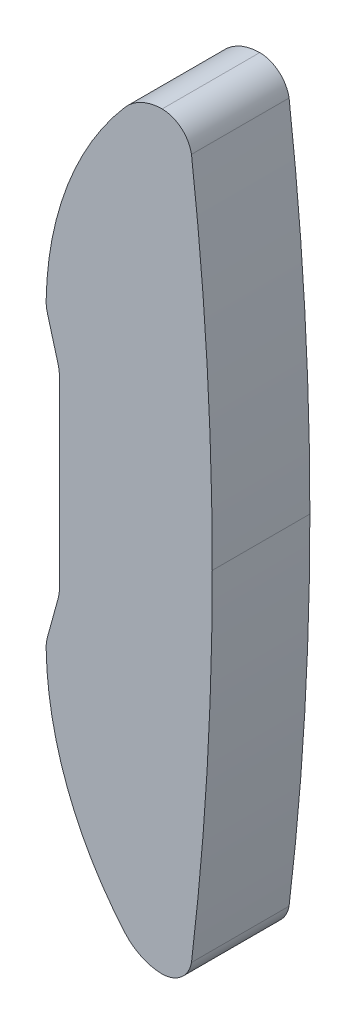
ISO-10303-21;
HEADER;
FILE_DESCRIPTION(('STEP AP214'),'2;1');
FILE_NAME('part.step','',(''),(''),'','','');
FILE_SCHEMA(('AUTOMOTIVE_DESIGN { 1 0 10303 214 1 1 1 1 }'));
ENDSEC;
DATA;
#1=APPLICATION_CONTEXT('core data for automotive mechanical design processes');
#2=APPLICATION_PROTOCOL_DEFINITION('international standard','automotive_design',2000,#1);
#3=PRODUCT_CONTEXT('',#1,'mechanical');
#4=PRODUCT('Part','Part','',(#3));
#5=PRODUCT_RELATED_PRODUCT_CATEGORY('part','',(#4));
#6=PRODUCT_DEFINITION_FORMATION('','',#4);
#7=PRODUCT_DEFINITION_CONTEXT('part definition',#1,'design');
#8=PRODUCT_DEFINITION('design','',#6,#7);
#9=PRODUCT_DEFINITION_SHAPE('','',#8);
#10=(LENGTH_UNIT() NAMED_UNIT(*) SI_UNIT(.MILLI.,.METRE.));
#11=(NAMED_UNIT(*) PLANE_ANGLE_UNIT() SI_UNIT($,.RADIAN.));
#12=(NAMED_UNIT(*) SI_UNIT($,.STERADIAN.) SOLID_ANGLE_UNIT());
#13=UNCERTAINTY_MEASURE_WITH_UNIT(LENGTH_MEASURE(1.E-05),#10,'distance_accuracy_value','');
#14=(GEOMETRIC_REPRESENTATION_CONTEXT(3) GLOBAL_UNCERTAINTY_ASSIGNED_CONTEXT((#13)) GLOBAL_UNIT_ASSIGNED_CONTEXT((#10,
#11,#12)) REPRESENTATION_CONTEXT('',''));
#15=CARTESIAN_POINT('',(0.,0.,0.));
#16=DIRECTION('',(0.,0.,1.));
#17=DIRECTION('',(1.,0.,0.));
#18=AXIS2_PLACEMENT_3D('',#15,#16,#17);
#19=CARTESIAN_POINT('',(-496.845318032392,-60.0507965039955,41.6977423367199));
#20=DIRECTION('',(0.,0.,1.));
#21=DIRECTION('',(1.,0.,0.));
#22=AXIS2_PLACEMENT_3D('',#19,#20,#21);
#23=CYLINDRICAL_SURFACE('',#22,554.203613489206);
#24=CARTESIAN_POINT('',(-496.845318032392,-60.0507965039955,41.6977423367199));
#25=DIRECTION('',(0.,0.,1.));
#26=DIRECTION('',(1.,0.,0.));
#27=AXIS2_PLACEMENT_3D('',#24,#25,#26);
#28=CIRCLE('',#27,554.203613489206);
#29=CARTESIAN_POINT('',(57.3581505300624,-59.6500000000382,41.6977423367199));
#30=VERTEX_POINT('',#29);
#31=CARTESIAN_POINT('',(53.4233595902934,-125.975204972134,41.6977423367199));
#32=VERTEX_POINT('',#31);
#33=EDGE_CURVE('E236',#30,#32,#28,.F.);
#34=ORIENTED_EDGE('',*,*,#33,.F.);
#35=DIRECTION('',(0.,0.,-1.));
#36=VECTOR('',#35,1.);
#37=CARTESIAN_POINT('',(57.3581505300624,-59.6500000000003,50.9477423367199));
#38=LINE('',#37,#36);
#39=CARTESIAN_POINT('',(57.3581505300624,-59.6500000000382,60.1977423367199));
#40=VERTEX_POINT('',#39);
#41=EDGE_CURVE('E190',#40,#30,#38,.T.);
#42=ORIENTED_EDGE('',*,*,#41,.F.);
#43=CARTESIAN_POINT('',(-496.845318032392,-60.0507965039955,60.1977423367199));
#44=DIRECTION('',(0.,0.,1.));
#45=DIRECTION('',(1.,0.,0.));
#46=AXIS2_PLACEMENT_3D('',#43,#44,#45);
#47=CIRCLE('',#46,554.203613489206);
#48=CARTESIAN_POINT('',(53.4233595902862,-125.975204972194,60.1977423367199));
#49=VERTEX_POINT('',#48);
#50=EDGE_CURVE('E245',#49,#40,#47,.T.);
#51=ORIENTED_EDGE('',*,*,#50,.F.);
#52=DIRECTION('',(0.,0.,1.));
#53=VECTOR('',#52,1.);
#54=CARTESIAN_POINT('',(53.4233595902931,-125.975204972136,50.9477423367199));
#55=LINE('',#54,#53);
#56=EDGE_CURVE('E187',#32,#49,#55,.T.);
#57=ORIENTED_EDGE('',*,*,#56,.F.);
#58=EDGE_LOOP('',(#34,#42,#51,#57));
#59=FACE_BOUND('',#58,.T.);
#60=ADVANCED_FACE('F16',(#59),#23,.T.);
#61=CARTESIAN_POINT('',(47.827182422053,-124.963178172978,41.6977423367199));
#62=DIRECTION('',(0.,0.,1.));
#63=DIRECTION('',(1.,0.,0.));
#64=AXIS2_PLACEMENT_3D('',#61,#62,#63);
#65=CYLINDRICAL_SURFACE('',#64,5.68694972199911);
#66=CARTESIAN_POINT('',(47.827182422053,-124.963178172978,41.6977423367199));
#67=DIRECTION('',(0.,0.,1.));
#68=DIRECTION('',(1.,0.,0.));
#69=AXIS2_PLACEMENT_3D('',#66,#67,#68);
#70=CIRCLE('',#69,5.68694972199911);
#71=CARTESIAN_POINT('',(47.8653222732101,-130.65,41.6977423367199));
#72=VERTEX_POINT('',#71);
#73=EDGE_CURVE('E232',#32,#72,#70,.F.);
#74=ORIENTED_EDGE('',*,*,#73,.F.);
#75=ORIENTED_EDGE('',*,*,#56,.T.);
#76=CARTESIAN_POINT('',(47.827182422053,-124.963178172978,60.1977423367199));
#77=DIRECTION('',(0.,0.,1.));
#78=DIRECTION('',(1.,0.,0.));
#79=AXIS2_PLACEMENT_3D('',#76,#77,#78);
#80=CIRCLE('',#79,5.68694972199911);
#81=CARTESIAN_POINT('',(47.8653222732101,-130.65,60.1977423367199));
#82=VERTEX_POINT('',#81);
#83=EDGE_CURVE('E248',#82,#49,#80,.T.);
#84=ORIENTED_EDGE('',*,*,#83,.F.);
#85=DIRECTION('',(0.,0.,1.));
#86=VECTOR('',#85,1.);
#87=CARTESIAN_POINT('',(47.8653222732027,-130.65,50.9477423367199));
#88=LINE('',#87,#86);
#89=EDGE_CURVE('E184',#72,#82,#88,.T.);
#90=ORIENTED_EDGE('',*,*,#89,.F.);
#91=EDGE_LOOP('',(#74,#75,#84,#90));
#92=FACE_BOUND('',#91,.T.);
#93=ADVANCED_FACE('F332',(#92),#65,.T.);
#94=CARTESIAN_POINT('',(47.9080909965827,-121.279696973285,41.6977423367199));
#95=DIRECTION('',(0.,0.,1.));
#96=DIRECTION('',(1.,0.,0.));
#97=AXIS2_PLACEMENT_3D('',#94,#95,#96);
#98=CYLINDRICAL_SURFACE('',#97,9.37040063050513);
#99=CARTESIAN_POINT('',(47.9080909965827,-121.279696973285,41.6977423367199));
#100=DIRECTION('',(0.,0.,1.));
#101=DIRECTION('',(1.,0.,0.));
#102=AXIS2_PLACEMENT_3D('',#99,#100,#101);
#103=CIRCLE('',#102,9.37040063050513);
#104=CARTESIAN_POINT('',(40.8083315663288,-127.395073004952,41.6977423367199));
#105=VERTEX_POINT('',#104);
#106=EDGE_CURVE('E228',#72,#105,#103,.F.);
#107=ORIENTED_EDGE('',*,*,#106,.F.);
#108=ORIENTED_EDGE('',*,*,#89,.T.);
#109=CARTESIAN_POINT('',(47.9080909965827,-121.279696973285,60.1977423367199));
#110=DIRECTION('',(0.,0.,1.));
#111=DIRECTION('',(1.,0.,0.));
#112=AXIS2_PLACEMENT_3D('',#109,#110,#111);
#113=CIRCLE('',#112,9.37040063050513);
#114=CARTESIAN_POINT('',(40.8083315663288,-127.395073004952,60.1977423367199));
#115=VERTEX_POINT('',#114);
#116=EDGE_CURVE('E251',#115,#82,#113,.T.);
#117=ORIENTED_EDGE('',*,*,#116,.F.);
#118=DIRECTION('',(0.,0.,1.));
#119=VECTOR('',#118,1.);
#120=CARTESIAN_POINT('',(40.8083315663282,-127.395073004951,50.9477423367199));
#121=LINE('',#120,#119);
#122=EDGE_CURVE('E181',#105,#115,#121,.T.);
#123=ORIENTED_EDGE('',*,*,#122,.F.);
#124=EDGE_LOOP('',(#107,#108,#117,#123));
#125=FACE_BOUND('',#124,.T.);
#126=ADVANCED_FACE('F326',(#125),#98,.T.);
#127=CARTESIAN_POINT('',(87.5315968420097,-87.1499999999983,41.6977423367199));
#128=DIRECTION('',(0.,0.,1.));
#129=DIRECTION('',(1.,0.,0.));
#130=AXIS2_PLACEMENT_3D('',#127,#128,#129);
#131=CYLINDRICAL_SURFACE('',#130,61.6662745688085);
#132=CARTESIAN_POINT('',(87.5315968420097,-87.1499999999983,41.6977423367199));
#133=DIRECTION('',(0.,0.,1.));
#134=DIRECTION('',(1.,0.,0.));
#135=AXIS2_PLACEMENT_3D('',#132,#133,#134);
#136=CIRCLE('',#135,61.6662745688085);
#137=CARTESIAN_POINT('',(25.874285577416,-88.2013737759151,41.6977423367199));
#138=VERTEX_POINT('',#137);
#139=EDGE_CURVE('E224',#105,#138,#136,.F.);
#140=ORIENTED_EDGE('',*,*,#139,.F.);
#141=ORIENTED_EDGE('',*,*,#122,.T.);
#142=CARTESIAN_POINT('',(87.5315968420097,-87.1499999999983,60.1977423367199));
#143=DIRECTION('',(0.,0.,1.));
#144=DIRECTION('',(1.,0.,0.));
#145=AXIS2_PLACEMENT_3D('',#142,#143,#144);
#146=CIRCLE('',#145,61.6662745688085);
#147=CARTESIAN_POINT('',(25.874285577416,-88.2013737759151,60.1977423367199));
#148=VERTEX_POINT('',#147);
#149=EDGE_CURVE('E255',#148,#115,#146,.T.);
#150=ORIENTED_EDGE('',*,*,#149,.F.);
#151=DIRECTION('',(0.,0.,1.));
#152=VECTOR('',#151,1.);
#153=CARTESIAN_POINT('',(25.874285577416,-88.2013737759151,50.9477423367199));
#154=LINE('',#153,#152);
#155=EDGE_CURVE('E178',#138,#148,#154,.T.);
#156=ORIENTED_EDGE('',*,*,#155,.F.);
#157=EDGE_LOOP('',(#140,#141,#150,#156));
#158=FACE_BOUND('',#157,.T.);
#159=ADVANCED_FACE('F322',(#158),#131,.T.);
#160=CARTESIAN_POINT('',(32.9668290322448,-88.0804324951486,41.6977423367199));
#161=DIRECTION('',(0.,0.,1.));
#162=DIRECTION('',(1.,0.,0.));
#163=AXIS2_PLACEMENT_3D('',#160,#161,#162);
#164=CYLINDRICAL_SURFACE('',#163,7.09357451867733);
#165=CARTESIAN_POINT('',(32.9668290322448,-88.0804324951486,41.6977423367199));
#166=DIRECTION('',(0.,0.,1.));
#167=DIRECTION('',(1.,0.,0.));
#168=AXIS2_PLACEMENT_3D('',#165,#166,#167);
#169=CIRCLE('',#168,7.09357451867733);
#170=CARTESIAN_POINT('',(26.128017971963,-86.1964307080488,41.6977423367199));
#171=VERTEX_POINT('',#170);
#172=EDGE_CURVE('E220',#138,#171,#169,.F.);
#173=ORIENTED_EDGE('',*,*,#172,.F.);
#174=ORIENTED_EDGE('',*,*,#155,.T.);
#175=CARTESIAN_POINT('',(32.9668290322448,-88.0804324951486,60.1977423367199));
#176=DIRECTION('',(0.,0.,1.));
#177=DIRECTION('',(1.,0.,0.));
#178=AXIS2_PLACEMENT_3D('',#175,#176,#177);
#179=CIRCLE('',#178,7.09357451867733);
#180=CARTESIAN_POINT('',(26.128017971963,-86.1964307080488,60.1977423367199));
#181=VERTEX_POINT('',#180);
#182=EDGE_CURVE('E259',#181,#148,#179,.T.);
#183=ORIENTED_EDGE('',*,*,#182,.F.);
#184=DIRECTION('',(0.,0.,1.));
#185=VECTOR('',#184,1.);
#186=CARTESIAN_POINT('',(26.1280179719631,-86.1964307080484,50.9477423367199));
#187=LINE('',#186,#185);
#188=EDGE_CURVE('E175',#171,#181,#187,.T.);
#189=ORIENTED_EDGE('',*,*,#188,.F.);
#190=EDGE_LOOP('',(#173,#174,#183,#189));
#191=FACE_BOUND('',#190,.T.);
#192=ADVANCED_FACE('F319',(#191),#164,.T.);
#193=CARTESIAN_POINT('',(26.127752379238,-86.1973947933685,60.1987423367199));
#194=DIRECTION('',(-0.964085320070353,0.265592725097743,0.));
#195=DIRECTION('',(0.265592725097743,0.964085320070353,0.));
#196=AXIS2_PLACEMENT_3D('',#193,#194,#195);
#197=PLANE('',#196);
#198=DIRECTION('',(0.265592725097745,0.964085320070352,0.));
#199=VECTOR('',#198,1.);
#200=CARTESIAN_POINT('',(26.1280179719631,-86.1964307080484,41.6977423367199));
#201=LINE('',#200,#199);
#202=CARTESIAN_POINT('',(28.1326869902101,-78.9196049916042,41.6977423367199));
#203=VERTEX_POINT('',#202);
#204=EDGE_CURVE('E216',#171,#203,#201,.T.);
#205=ORIENTED_EDGE('',*,*,#204,.F.);
#206=ORIENTED_EDGE('',*,*,#188,.T.);
#207=DIRECTION('',(-0.265592725097745,-0.964085320070352,0.));
#208=VECTOR('',#207,1.);
#209=CARTESIAN_POINT('',(28.13268699021,-78.9196049916045,60.1977423367199));
#210=LINE('',#209,#208);
#211=CARTESIAN_POINT('',(28.1326869902101,-78.9196049916042,60.1977423367199));
#212=VERTEX_POINT('',#211);
#213=EDGE_CURVE('E263',#212,#181,#210,.T.);
#214=ORIENTED_EDGE('',*,*,#213,.F.);
#215=DIRECTION('',(0.,0.,1.));
#216=VECTOR('',#215,1.);
#217=CARTESIAN_POINT('',(28.13268699021,-78.9196049916045,50.9477423367199));
#218=LINE('',#217,#216);
#219=EDGE_CURVE('E172',#203,#212,#218,.T.);
#220=ORIENTED_EDGE('',*,*,#219,.F.);
#221=EDGE_LOOP('',(#205,#206,#214,#220));
#222=FACE_BOUND('',#221,.T.);
#223=ADVANCED_FACE('F314',(#222),#197,.T.);
#224=CARTESIAN_POINT('',(21.2938759299292,-77.0356032045048,60.1977423367199));
#225=DIRECTION('',(0.,0.,-1.));
#226=DIRECTION('',(-1.,0.,0.));
#227=AXIS2_PLACEMENT_3D('',#224,#225,#226);
#228=CYLINDRICAL_SURFACE('',#227,7.09357451867627);
#229=CARTESIAN_POINT('',(21.2938759299292,-77.0356032045048,41.6977423367199));
#230=DIRECTION('',(0.,0.,-1.));
#231=DIRECTION('',(-1.,0.,0.));
#232=AXIS2_PLACEMENT_3D('',#229,#230,#231);
#233=CIRCLE('',#232,7.09357451867627);
#234=CARTESIAN_POINT('',(28.3874504486055,-77.0356032045048,41.6977423367199));
#235=VERTEX_POINT('',#234);
#236=EDGE_CURVE('E212',#203,#235,#233,.F.);
#237=ORIENTED_EDGE('',*,*,#236,.F.);
#238=ORIENTED_EDGE('',*,*,#219,.T.);
#239=CARTESIAN_POINT('',(21.2938759299292,-77.0356032045048,60.1977423367199));
#240=DIRECTION('',(0.,0.,-1.));
#241=DIRECTION('',(-1.,0.,0.));
#242=AXIS2_PLACEMENT_3D('',#239,#240,#241);
#243=CIRCLE('',#242,7.09357451867627);
#244=CARTESIAN_POINT('',(28.3874504486055,-77.0356032045048,60.1977423367199));
#245=VERTEX_POINT('',#244);
#246=EDGE_CURVE('E267',#245,#212,#243,.T.);
#247=ORIENTED_EDGE('',*,*,#246,.F.);
#248=DIRECTION('',(0.,0.,1.));
#249=VECTOR('',#248,1.);
#250=CARTESIAN_POINT('',(28.3874504486055,-77.0356032045048,50.9477423367199));
#251=LINE('',#250,#249);
#252=EDGE_CURVE('E169',#235,#245,#251,.T.);
#253=ORIENTED_EDGE('',*,*,#252,.F.);
#254=EDGE_LOOP('',(#237,#238,#247,#253));
#255=FACE_BOUND('',#254,.T.);
#256=ADVANCED_FACE('F310',(#255),#228,.F.);
#257=CARTESIAN_POINT('',(28.3874504486055,-77.0366032045048,60.1987423367199));
#258=DIRECTION('',(-1.,0.,0.));
#259=DIRECTION('',(0.,1.,0.));
#260=AXIS2_PLACEMENT_3D('',#257,#258,#259);
#261=PLANE('',#260);
#262=DIRECTION('',(0.,1.,0.));
#263=VECTOR('',#262,1.);
#264=CARTESIAN_POINT('',(28.3874504486055,-59.65,41.6977423367199));
#265=LINE('',#264,#263);
#266=CARTESIAN_POINT('',(28.3874504486055,-42.2643967954953,41.6977423367199));
#267=VERTEX_POINT('',#266);
#268=EDGE_CURVE('E211',#235,#267,#265,.T.);
#269=ORIENTED_EDGE('',*,*,#268,.F.);
#270=ORIENTED_EDGE('',*,*,#252,.T.);
#271=DIRECTION('',(0.,-1.,0.));
#272=VECTOR('',#271,1.);
#273=CARTESIAN_POINT('',(28.3874504486055,-59.65,60.1977423367199));
#274=LINE('',#273,#272);
#275=CARTESIAN_POINT('',(28.3874504486055,-42.2643967954953,60.1977423367199));
#276=VERTEX_POINT('',#275);
#277=EDGE_CURVE('E157',#276,#245,#274,.T.);
#278=ORIENTED_EDGE('',*,*,#277,.F.);
#279=DIRECTION('',(0.,0.,1.));
#280=VECTOR('',#279,1.);
#281=CARTESIAN_POINT('',(28.3874504486055,-42.2643967954953,50.9477423367199));
#282=LINE('',#281,#280);
#283=EDGE_CURVE('E166',#267,#276,#282,.T.);
#284=ORIENTED_EDGE('',*,*,#283,.F.);
#285=EDGE_LOOP('',(#269,#270,#278,#284));
#286=FACE_BOUND('',#285,.T.);
#287=ADVANCED_FACE('F308',(#286),#261,.T.);
#288=CARTESIAN_POINT('',(21.2938759299279,-42.2643967954953,60.1977423367199));
#289=DIRECTION('',(0.,0.,-1.));
#290=DIRECTION('',(-1.,0.,0.));
#291=AXIS2_PLACEMENT_3D('',#288,#289,#290);
#292=CYLINDRICAL_SURFACE('',#291,7.09357451867759);
#293=CARTESIAN_POINT('',(21.2938759299279,-42.2643967954953,41.6977423367199));
#294=DIRECTION('',(0.,0.,-1.));
#295=DIRECTION('',(-1.,0.,0.));
#296=AXIS2_PLACEMENT_3D('',#293,#294,#295);
#297=CIRCLE('',#296,7.09357451867759);
#298=CARTESIAN_POINT('',(28.13268699021,-40.3803950083956,41.6977423367199));
#299=VERTEX_POINT('',#298);
#300=EDGE_CURVE('E207',#267,#299,#297,.F.);
#301=ORIENTED_EDGE('',*,*,#300,.F.);
#302=ORIENTED_EDGE('',*,*,#283,.T.);
#303=CARTESIAN_POINT('',(21.2938759299279,-42.2643967954953,60.1977423367199));
#304=DIRECTION('',(0.,0.,-1.));
#305=DIRECTION('',(-1.,0.,0.));
#306=AXIS2_PLACEMENT_3D('',#303,#304,#305);
#307=CIRCLE('',#306,7.09357451867759);
#308=CARTESIAN_POINT('',(28.13268699021,-40.3803950083956,60.1977423367199));
#309=VERTEX_POINT('',#308);
#310=EDGE_CURVE('E271',#309,#276,#307,.T.);
#311=ORIENTED_EDGE('',*,*,#310,.F.);
#312=DIRECTION('',(0.,0.,1.));
#313=VECTOR('',#312,1.);
#314=CARTESIAN_POINT('',(28.13268699021,-40.3803950083955,50.9477423367199));
#315=LINE('',#314,#313);
#316=EDGE_CURVE('E163',#299,#309,#315,.T.);
#317=ORIENTED_EDGE('',*,*,#316,.F.);
#318=EDGE_LOOP('',(#301,#302,#311,#317));
#319=FACE_BOUND('',#318,.T.);
#320=ADVANCED_FACE('F289',(#319),#292,.F.);
#321=CARTESIAN_POINT('',(28.1329525829351,-40.3813590937156,60.1987423367199));
#322=DIRECTION('',(-0.964085320070352,-0.265592725097747,0.));
#323=DIRECTION('',(-0.265592725097747,0.964085320070352,0.));
#324=AXIS2_PLACEMENT_3D('',#321,#322,#323);
#325=PLANE('',#324);
#326=DIRECTION('',(-0.265592725097749,0.964085320070351,0.));
#327=VECTOR('',#326,1.);
#328=CARTESIAN_POINT('',(28.13268699021,-40.3803950083955,41.6977423367199));
#329=LINE('',#328,#327);
#330=CARTESIAN_POINT('',(26.128017971963,-33.1035692919514,41.6977423367199));
#331=VERTEX_POINT('',#330);
#332=EDGE_CURVE('E203',#299,#331,#329,.T.);
#333=ORIENTED_EDGE('',*,*,#332,.F.);
#334=ORIENTED_EDGE('',*,*,#316,.T.);
#335=DIRECTION('',(0.265592725097749,-0.964085320070351,0.));
#336=VECTOR('',#335,1.);
#337=CARTESIAN_POINT('',(26.1280179719631,-33.1035692919517,60.1977423367199));
#338=LINE('',#337,#336);
#339=CARTESIAN_POINT('',(26.128017971963,-33.1035692919514,60.1977423367199));
#340=VERTEX_POINT('',#339);
#341=EDGE_CURVE('E275',#340,#309,#338,.T.);
#342=ORIENTED_EDGE('',*,*,#341,.F.);
#343=DIRECTION('',(0.,0.,1.));
#344=VECTOR('',#343,1.);
#345=CARTESIAN_POINT('',(26.1280179719631,-33.1035692919517,50.9477423367199));
#346=LINE('',#345,#344);
#347=EDGE_CURVE('E160',#331,#340,#346,.T.);
#348=ORIENTED_EDGE('',*,*,#347,.F.);
#349=EDGE_LOOP('',(#333,#334,#342,#348));
#350=FACE_BOUND('',#349,.T.);
#351=ADVANCED_FACE('F285',(#350),#325,.T.);
#352=CARTESIAN_POINT('',(32.9668290322457,-31.2195675048514,41.6977423367196));
#353=DIRECTION('',(0.,0.,1.));
#354=DIRECTION('',(1.,0.,0.));
#355=AXIS2_PLACEMENT_3D('',#352,#353,#354);
#356=CYLINDRICAL_SURFACE('',#355,7.0935745186782);
#357=CARTESIAN_POINT('',(32.9668290322457,-31.2195675048514,41.6977423367196));
#358=DIRECTION('',(0.,0.,1.));
#359=DIRECTION('',(1.,0.,0.));
#360=AXIS2_PLACEMENT_3D('',#357,#358,#359);
#361=CIRCLE('',#360,7.0935745186782);
#362=CARTESIAN_POINT('',(25.874285577416,-31.0986262240849,41.6977423367197));
#363=VERTEX_POINT('',#362);
#364=EDGE_CURVE('E199',#331,#363,#361,.F.);
#365=ORIENTED_EDGE('',*,*,#364,.F.);
#366=ORIENTED_EDGE('',*,*,#347,.T.);
#367=CARTESIAN_POINT('',(32.9668290322466,-31.2195675048512,60.1977423367196));
#368=DIRECTION('',(0.,0.,1.));
#369=DIRECTION('',(1.,0.,0.));
#370=AXIS2_PLACEMENT_3D('',#367,#368,#369);
#371=CIRCLE('',#370,7.0935745186782);
#372=CARTESIAN_POINT('',(25.8742855774164,-31.0986262240848,60.1977423367197));
#373=VERTEX_POINT('',#372);
#374=EDGE_CURVE('E133',#373,#340,#371,.T.);
#375=ORIENTED_EDGE('',*,*,#374,.F.);
#376=DIRECTION('',(0.,0.,1.));
#377=VECTOR('',#376,1.);
#378=CARTESIAN_POINT('',(25.874285577416,-31.0986262240849,50.9477423367199));
#379=LINE('',#378,#377);
#380=EDGE_CURVE('E128',#363,#373,#379,.T.);
#381=ORIENTED_EDGE('',*,*,#380,.F.);
#382=EDGE_LOOP('',(#365,#366,#375,#381));
#383=FACE_BOUND('',#382,.T.);
#384=ADVANCED_FACE('F282',(#383),#356,.T.);
#385=CARTESIAN_POINT('',(87.531596842011,-32.1500000000017,41.6977423367199));
#386=DIRECTION('',(0.,0.,1.));
#387=DIRECTION('',(1.,0.,0.));
#388=AXIS2_PLACEMENT_3D('',#385,#386,#387);
#389=CYLINDRICAL_SURFACE('',#388,61.6662745688097);
#390=CARTESIAN_POINT('',(87.531596842011,-32.1500000000017,41.6977423367199));
#391=DIRECTION('',(0.,0.,1.));
#392=DIRECTION('',(1.,0.,0.));
#393=AXIS2_PLACEMENT_3D('',#390,#391,#392);
#394=CIRCLE('',#393,61.6662745688097);
#395=CARTESIAN_POINT('',(40.8083315663283,8.09507300495155,41.6977423367199));
#396=VERTEX_POINT('',#395);
#397=EDGE_CURVE('E142',#363,#396,#394,.F.);
#398=ORIENTED_EDGE('',*,*,#397,.F.);
#399=ORIENTED_EDGE('',*,*,#380,.T.);
#400=CARTESIAN_POINT('',(87.531596842011,-32.1500000000017,60.1977423367199));
#401=DIRECTION('',(0.,0.,1.));
#402=DIRECTION('',(1.,0.,0.));
#403=AXIS2_PLACEMENT_3D('',#400,#401,#402);
#404=CIRCLE('',#403,61.6662745688097);
#405=CARTESIAN_POINT('',(40.8083315663283,8.09507300495155,60.1977423367199));
#406=VERTEX_POINT('',#405);
#407=EDGE_CURVE('E20',#406,#373,#404,.T.);
#408=ORIENTED_EDGE('',*,*,#407,.F.);
#409=DIRECTION('',(0.,0.,1.));
#410=VECTOR('',#409,1.);
#411=CARTESIAN_POINT('',(40.8083315663282,8.09507300495143,50.9477423367199));
#412=LINE('',#411,#410);
#413=EDGE_CURVE('E127',#396,#406,#412,.T.);
#414=ORIENTED_EDGE('',*,*,#413,.F.);
#415=EDGE_LOOP('',(#398,#399,#408,#414));
#416=FACE_BOUND('',#415,.T.);
#417=ADVANCED_FACE('F125',(#416),#389,.T.);
#418=CARTESIAN_POINT('',(25.8558802072326,-130.651,60.1977423367199));
#419=DIRECTION('',(0.,0.,1.));
#420=DIRECTION('',(1.,0.,0.));
#421=AXIS2_PLACEMENT_3D('',#418,#419,#420);
#422=PLANE('',#421);
#423=ORIENTED_EDGE('',*,*,#83,.T.);
#424=ORIENTED_EDGE('',*,*,#50,.T.);
#425=CARTESIAN_POINT('',(-496.845318032348,-59.249203496003,60.1977423367199));
#426=DIRECTION('',(0.,0.,1.));
#427=DIRECTION('',(1.,0.,0.));
#428=AXIS2_PLACEMENT_3D('',#425,#426,#427);
#429=CIRCLE('',#428,554.203613489162);
#430=CARTESIAN_POINT('',(53.4233595903006,6.67520497207353,60.1977423367199));
#431=VERTEX_POINT('',#430);
#432=EDGE_CURVE('E193',#431,#40,#429,.F.);
#433=ORIENTED_EDGE('',*,*,#432,.F.);
#434=CARTESIAN_POINT('',(47.8271824220534,5.66317817297779,60.1977423367199));
#435=DIRECTION('',(0.,0.,1.));
#436=DIRECTION('',(1.,0.,0.));
#437=AXIS2_PLACEMENT_3D('',#434,#435,#436);
#438=CIRCLE('',#437,5.68694972199878);
#439=CARTESIAN_POINT('',(47.8653222732036,11.35,60.1977423367199));
#440=VERTEX_POINT('',#439);
#441=EDGE_CURVE('E139',#440,#431,#438,.F.);
#442=ORIENTED_EDGE('',*,*,#441,.F.);
#443=CARTESIAN_POINT('',(47.9080909965834,1.97969697328274,60.1977423367199));
#444=DIRECTION('',(0.,0.,1.));
#445=DIRECTION('',(1.,0.,0.));
#446=AXIS2_PLACEMENT_3D('',#443,#444,#445);
#447=CIRCLE('',#446,9.37040063050699);
#448=EDGE_CURVE('E135',#406,#440,#447,.F.);
#449=ORIENTED_EDGE('',*,*,#448,.F.);
#450=ORIENTED_EDGE('',*,*,#407,.T.);
#451=ORIENTED_EDGE('',*,*,#374,.T.);
#452=ORIENTED_EDGE('',*,*,#341,.T.);
#453=ORIENTED_EDGE('',*,*,#310,.T.);
#454=ORIENTED_EDGE('',*,*,#277,.T.);
#455=ORIENTED_EDGE('',*,*,#246,.T.);
#456=ORIENTED_EDGE('',*,*,#213,.T.);
#457=ORIENTED_EDGE('',*,*,#182,.T.);
#458=ORIENTED_EDGE('',*,*,#149,.T.);
#459=ORIENTED_EDGE('',*,*,#116,.T.);
#460=EDGE_LOOP('',(#423,#424,#433,#442,#449,#450,#451,#452,#453,#454,#455,#456,#457,#458,#459));
#461=FACE_BOUND('',#460,.T.);
#462=ADVANCED_FACE('F137',(#461),#422,.T.);
#463=CARTESIAN_POINT('',(-496.845318032348,-59.249203496003,41.6977423367199));
#464=DIRECTION('',(0.,0.,1.));
#465=DIRECTION('',(1.,0.,0.));
#466=AXIS2_PLACEMENT_3D('',#463,#464,#465);
#467=CYLINDRICAL_SURFACE('',#466,554.203613489162);
#468=CARTESIAN_POINT('',(-496.845318032348,-59.249203496003,41.6977423367199));
#469=DIRECTION('',(0.,0.,1.));
#470=DIRECTION('',(1.,0.,0.));
#471=AXIS2_PLACEMENT_3D('',#468,#469,#470);
#472=CIRCLE('',#471,554.203613489162);
#473=CARTESIAN_POINT('',(53.4233595903006,6.67520497207353,41.6977423367199));
#474=VERTEX_POINT('',#473);
#475=EDGE_CURVE('E192',#474,#30,#472,.F.);
#476=ORIENTED_EDGE('',*,*,#475,.F.);
#477=DIRECTION('',(0.,0.,-1.));
#478=VECTOR('',#477,1.);
#479=CARTESIAN_POINT('',(53.4233595902931,6.675204972136,50.9477423367199));
#480=LINE('',#479,#478);
#481=EDGE_CURVE('E151',#431,#474,#480,.T.);
#482=ORIENTED_EDGE('',*,*,#481,.F.);
#483=ORIENTED_EDGE('',*,*,#432,.T.);
#484=ORIENTED_EDGE('',*,*,#41,.T.);
#485=EDGE_LOOP('',(#476,#482,#483,#484));
#486=FACE_BOUND('',#485,.T.);
#487=ADVANCED_FACE('F336',(#486),#467,.T.);
#488=CARTESIAN_POINT('',(57.3832189598291,-130.651,41.6977423367199));
#489=DIRECTION('',(0.,0.,-1.));
#490=DIRECTION('',(-1.,0.,0.));
#491=AXIS2_PLACEMENT_3D('',#488,#489,#490);
#492=PLANE('',#491);
#493=CARTESIAN_POINT('',(47.9080909965834,1.97969697328274,41.6977423367199));
#494=DIRECTION('',(0.,0.,1.));
#495=DIRECTION('',(1.,0.,0.));
#496=AXIS2_PLACEMENT_3D('',#493,#494,#495);
#497=CIRCLE('',#496,9.37040063050699);
#498=CARTESIAN_POINT('',(47.8653222732036,11.35,41.6977423367199));
#499=VERTEX_POINT('',#498);
#500=EDGE_CURVE('E36',#499,#396,#497,.T.);
#501=ORIENTED_EDGE('',*,*,#500,.F.);
#502=CARTESIAN_POINT('',(47.8271824220534,5.66317817297779,41.6977423367199));
#503=DIRECTION('',(0.,0.,1.));
#504=DIRECTION('',(1.,0.,0.));
#505=AXIS2_PLACEMENT_3D('',#502,#503,#504);
#506=CIRCLE('',#505,5.68694972199878);
#507=EDGE_CURVE('E27',#474,#499,#506,.T.);
#508=ORIENTED_EDGE('',*,*,#507,.F.);
#509=ORIENTED_EDGE('',*,*,#475,.T.);
#510=ORIENTED_EDGE('',*,*,#33,.T.);
#511=ORIENTED_EDGE('',*,*,#73,.T.);
#512=ORIENTED_EDGE('',*,*,#106,.T.);
#513=ORIENTED_EDGE('',*,*,#139,.T.);
#514=ORIENTED_EDGE('',*,*,#172,.T.);
#515=ORIENTED_EDGE('',*,*,#204,.T.);
#516=ORIENTED_EDGE('',*,*,#236,.T.);
#517=ORIENTED_EDGE('',*,*,#268,.T.);
#518=ORIENTED_EDGE('',*,*,#300,.T.);
#519=ORIENTED_EDGE('',*,*,#332,.T.);
#520=ORIENTED_EDGE('',*,*,#364,.T.);
#521=ORIENTED_EDGE('',*,*,#397,.T.);
#522=EDGE_LOOP('',(#501,#508,#509,#510,#511,#512,#513,#514,#515,#516,#517,#518,#519,#520,#521));
#523=FACE_BOUND('',#522,.T.);
#524=ADVANCED_FACE('F306',(#523),#492,.T.);
#525=CARTESIAN_POINT('',(47.9080909965834,1.97969697328274,41.6977423367199));
#526=DIRECTION('',(0.,0.,1.));
#527=DIRECTION('',(1.,0.,0.));
#528=AXIS2_PLACEMENT_3D('',#525,#526,#527);
#529=CYLINDRICAL_SURFACE('',#528,9.37040063050699);
#530=ORIENTED_EDGE('',*,*,#500,.T.);
#531=ORIENTED_EDGE('',*,*,#413,.T.);
#532=ORIENTED_EDGE('',*,*,#448,.T.);
#533=DIRECTION('',(0.,0.,1.));
#534=VECTOR('',#533,1.);
#535=CARTESIAN_POINT('',(47.8653222732027,11.35,50.9477423367199));
#536=LINE('',#535,#534);
#537=EDGE_CURVE('E11',#499,#440,#536,.T.);
#538=ORIENTED_EDGE('',*,*,#537,.F.);
#539=EDGE_LOOP('',(#530,#531,#532,#538));
#540=FACE_BOUND('',#539,.T.);
#541=ADVANCED_FACE('F144',(#540),#529,.T.);
#542=CARTESIAN_POINT('',(47.8271824220534,5.66317817297779,41.6977423367199));
#543=DIRECTION('',(0.,0.,1.));
#544=DIRECTION('',(1.,0.,0.));
#545=AXIS2_PLACEMENT_3D('',#542,#543,#544);
#546=CYLINDRICAL_SURFACE('',#545,5.68694972199878);
#547=ORIENTED_EDGE('',*,*,#507,.T.);
#548=ORIENTED_EDGE('',*,*,#537,.T.);
#549=ORIENTED_EDGE('',*,*,#441,.T.);
#550=ORIENTED_EDGE('',*,*,#481,.T.);
#551=EDGE_LOOP('',(#547,#548,#549,#550));
#552=FACE_BOUND('',#551,.T.);
#553=ADVANCED_FACE('F18',(#552),#546,.T.);
#554=CLOSED_SHELL('',(#60,#93,#126,#159,#192,#223,#256,#287,#320,#351,#384,#417,#462,#487,#524,
#541,#553));
#555=MANIFOLD_SOLID_BREP('B1',#554);
#556=ADVANCED_BREP_SHAPE_REPRESENTATION('',(#18,#555),#14);
#557=SHAPE_DEFINITION_REPRESENTATION(#9,#556);
ENDSEC;
END-ISO-10303-21;
